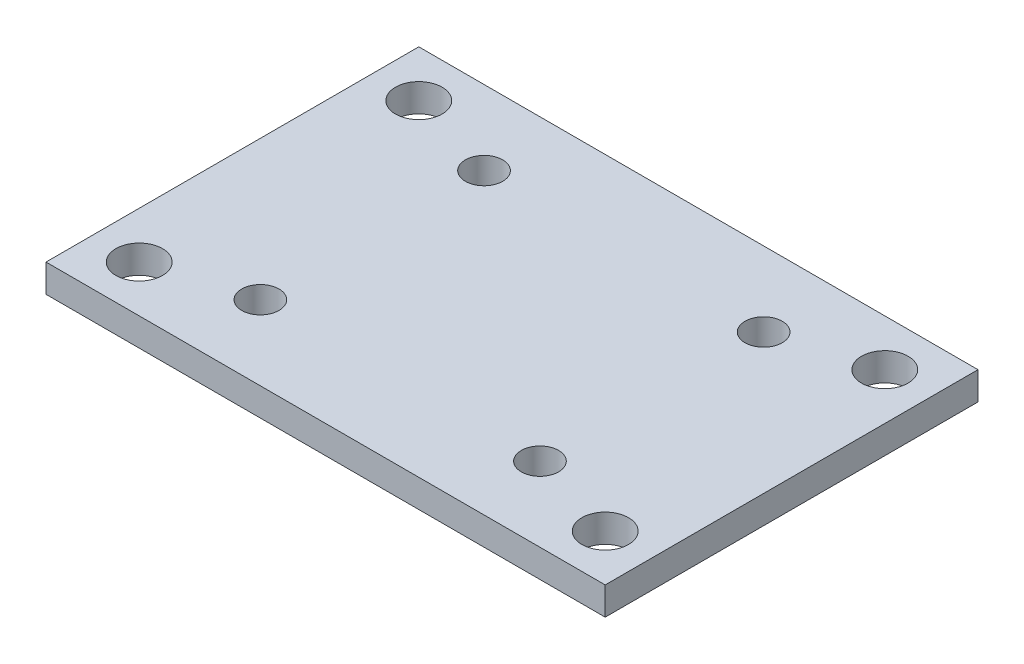
ISO-10303-21;
HEADER;
FILE_DESCRIPTION(('STEP AP214'),'2;1');
FILE_NAME('part.step','',(''),(''),'','','');
FILE_SCHEMA(('AUTOMOTIVE_DESIGN { 1 0 10303 214 1 1 1 1 }'));
ENDSEC;
DATA;
#1=APPLICATION_CONTEXT('core data for automotive mechanical design processes');
#2=APPLICATION_PROTOCOL_DEFINITION('international standard','automotive_design',2000,#1);
#3=PRODUCT_CONTEXT('',#1,'mechanical');
#4=PRODUCT('Part','Part','',(#3));
#5=PRODUCT_RELATED_PRODUCT_CATEGORY('part','',(#4));
#6=PRODUCT_DEFINITION_FORMATION('','',#4);
#7=PRODUCT_DEFINITION_CONTEXT('part definition',#1,'design');
#8=PRODUCT_DEFINITION('design','',#6,#7);
#9=PRODUCT_DEFINITION_SHAPE('','',#8);
#10=(LENGTH_UNIT() NAMED_UNIT(*) SI_UNIT(.MILLI.,.METRE.));
#11=(NAMED_UNIT(*) PLANE_ANGLE_UNIT() SI_UNIT($,.RADIAN.));
#12=(NAMED_UNIT(*) SI_UNIT($,.STERADIAN.) SOLID_ANGLE_UNIT());
#13=UNCERTAINTY_MEASURE_WITH_UNIT(LENGTH_MEASURE(1.E-05),#10,'distance_accuracy_value','');
#14=(GEOMETRIC_REPRESENTATION_CONTEXT(3) GLOBAL_UNCERTAINTY_ASSIGNED_CONTEXT((#13)) GLOBAL_UNIT_ASSIGNED_CONTEXT((#10,
#11,#12)) REPRESENTATION_CONTEXT('',''));
#15=CARTESIAN_POINT('',(0.,0.,0.));
#16=DIRECTION('',(0.,0.,1.));
#17=DIRECTION('',(1.,0.,0.));
#18=AXIS2_PLACEMENT_3D('',#15,#16,#17);
#19=CARTESIAN_POINT('',(-30.,3.,20.));
#20=DIRECTION('',(1.,0.,0.));
#21=DIRECTION('',(0.,0.,-1.));
#22=AXIS2_PLACEMENT_3D('',#19,#20,#21);
#23=PLANE('',#22);
#24=DIRECTION('',(0.,0.,1.));
#25=VECTOR('',#24,1.);
#26=CARTESIAN_POINT('',(-30.,0.,20.));
#27=LINE('',#26,#25);
#28=CARTESIAN_POINT('',(-30.,0.,-20.));
#29=VERTEX_POINT('',#28);
#30=CARTESIAN_POINT('',(-30.,0.,20.));
#31=VERTEX_POINT('',#30);
#32=EDGE_CURVE('E95',#29,#31,#27,.T.);
#33=ORIENTED_EDGE('',*,*,#32,.T.);
#34=DIRECTION('',(0.,-1.,0.));
#35=VECTOR('',#34,1.);
#36=CARTESIAN_POINT('',(-30.,3.,20.));
#37=LINE('',#36,#35);
#38=CARTESIAN_POINT('',(-30.,3.,20.));
#39=VERTEX_POINT('',#38);
#40=EDGE_CURVE('E11',#39,#31,#37,.T.);
#41=ORIENTED_EDGE('',*,*,#40,.F.);
#42=DIRECTION('',(0.,0.,1.));
#43=VECTOR('',#42,1.);
#44=CARTESIAN_POINT('',(-30.,3.,20.));
#45=LINE('',#44,#43);
#46=CARTESIAN_POINT('',(-30.,3.,-20.));
#47=VERTEX_POINT('',#46);
#48=EDGE_CURVE('E83',#47,#39,#45,.T.);
#49=ORIENTED_EDGE('',*,*,#48,.F.);
#50=DIRECTION('',(0.,-1.,0.));
#51=VECTOR('',#50,1.);
#52=CARTESIAN_POINT('',(-30.,3.,-20.));
#53=LINE('',#52,#51);
#54=EDGE_CURVE('E91',#47,#29,#53,.T.);
#55=ORIENTED_EDGE('',*,*,#54,.T.);
#56=EDGE_LOOP('',(#33,#41,#49,#55));
#57=FACE_BOUND('',#56,.T.);
#58=ADVANCED_FACE('F32',(#57),#23,.F.);
#59=CARTESIAN_POINT('',(30.,3.,20.));
#60=DIRECTION('',(0.,0.,-1.));
#61=DIRECTION('',(-1.,0.,0.));
#62=AXIS2_PLACEMENT_3D('',#59,#60,#61);
#63=PLANE('',#62);
#64=DIRECTION('',(1.,0.,0.));
#65=VECTOR('',#64,1.);
#66=CARTESIAN_POINT('',(30.,0.,20.));
#67=LINE('',#66,#65);
#68=CARTESIAN_POINT('',(30.,0.,20.));
#69=VERTEX_POINT('',#68);
#70=EDGE_CURVE('E87',#31,#69,#67,.T.);
#71=ORIENTED_EDGE('',*,*,#70,.T.);
#72=DIRECTION('',(0.,-1.,0.));
#73=VECTOR('',#72,1.);
#74=CARTESIAN_POINT('',(30.,3.,20.));
#75=LINE('',#74,#73);
#76=CARTESIAN_POINT('',(30.,3.,20.));
#77=VERTEX_POINT('',#76);
#78=EDGE_CURVE('E40',#77,#69,#75,.T.);
#79=ORIENTED_EDGE('',*,*,#78,.F.);
#80=DIRECTION('',(1.,0.,0.));
#81=VECTOR('',#80,1.);
#82=CARTESIAN_POINT('',(30.,3.,20.));
#83=LINE('',#82,#81);
#84=EDGE_CURVE('E78',#39,#77,#83,.T.);
#85=ORIENTED_EDGE('',*,*,#84,.F.);
#86=ORIENTED_EDGE('',*,*,#40,.T.);
#87=EDGE_LOOP('',(#71,#79,#85,#86));
#88=FACE_BOUND('',#87,.T.);
#89=ADVANCED_FACE('F86',(#88),#63,.F.);
#90=CARTESIAN_POINT('',(30.,3.,20.));
#91=DIRECTION('',(-1.,0.,0.));
#92=DIRECTION('',(0.,0.,1.));
#93=AXIS2_PLACEMENT_3D('',#90,#91,#92);
#94=PLANE('',#93);
#95=DIRECTION('',(0.,0.,-1.));
#96=VECTOR('',#95,1.);
#97=CARTESIAN_POINT('',(30.,0.,20.));
#98=LINE('',#97,#96);
#99=CARTESIAN_POINT('',(30.,0.,-20.));
#100=VERTEX_POINT('',#99);
#101=EDGE_CURVE('E65',#69,#100,#98,.T.);
#102=ORIENTED_EDGE('',*,*,#101,.T.);
#103=DIRECTION('',(0.,-1.,0.));
#104=VECTOR('',#103,1.);
#105=CARTESIAN_POINT('',(30.,3.,-20.));
#106=LINE('',#105,#104);
#107=CARTESIAN_POINT('',(30.,3.,-20.));
#108=VERTEX_POINT('',#107);
#109=EDGE_CURVE('E88',#108,#100,#106,.T.);
#110=ORIENTED_EDGE('',*,*,#109,.F.);
#111=DIRECTION('',(0.,0.,-1.));
#112=VECTOR('',#111,1.);
#113=CARTESIAN_POINT('',(30.,3.,20.));
#114=LINE('',#113,#112);
#115=EDGE_CURVE('E81',#77,#108,#114,.T.);
#116=ORIENTED_EDGE('',*,*,#115,.F.);
#117=ORIENTED_EDGE('',*,*,#78,.T.);
#118=EDGE_LOOP('',(#102,#110,#116,#117));
#119=FACE_BOUND('',#118,.T.);
#120=ADVANCED_FACE('F89',(#119),#94,.F.);
#121=CARTESIAN_POINT('',(30.,3.,-20.));
#122=DIRECTION('',(0.,0.,1.));
#123=DIRECTION('',(1.,0.,0.));
#124=AXIS2_PLACEMENT_3D('',#121,#122,#123);
#125=PLANE('',#124);
#126=DIRECTION('',(-1.,0.,0.));
#127=VECTOR('',#126,1.);
#128=CARTESIAN_POINT('',(30.,0.,-20.));
#129=LINE('',#128,#127);
#130=EDGE_CURVE('E71',#100,#29,#129,.T.);
#131=ORIENTED_EDGE('',*,*,#130,.T.);
#132=ORIENTED_EDGE('',*,*,#54,.F.);
#133=DIRECTION('',(-1.,0.,0.));
#134=VECTOR('',#133,1.);
#135=CARTESIAN_POINT('',(30.,3.,-20.));
#136=LINE('',#135,#134);
#137=EDGE_CURVE('E48',#108,#47,#136,.T.);
#138=ORIENTED_EDGE('',*,*,#137,.F.);
#139=ORIENTED_EDGE('',*,*,#109,.T.);
#140=EDGE_LOOP('',(#131,#132,#138,#139));
#141=FACE_BOUND('',#140,.T.);
#142=ADVANCED_FACE('F103',(#141),#125,.F.);
#143=CARTESIAN_POINT('',(0.,3.,0.));
#144=DIRECTION('',(0.,1.,0.));
#145=DIRECTION('',(0.,0.,1.));
#146=AXIS2_PLACEMENT_3D('',#143,#144,#145);
#147=PLANE('',#146);
#148=CARTESIAN_POINT('',(-25.,3.,15.));
#149=DIRECTION('',(0.,1.,0.));
#150=DIRECTION('',(0.,0.,1.));
#151=AXIS2_PLACEMENT_3D('',#148,#149,#150);
#152=CIRCLE('',#151,2.5);
#153=CARTESIAN_POINT('',(-25.,3.,17.5));
#154=VERTEX_POINT('',#153);
#155=EDGE_CURVE('E146',#154,#154,#152,.T.);
#156=ORIENTED_EDGE('',*,*,#155,.F.);
#157=EDGE_LOOP('',(#156));
#158=FACE_BOUND('',#157,.T.);
#159=CARTESIAN_POINT('',(25.,3.,-15.));
#160=DIRECTION('',(0.,1.,0.));
#161=DIRECTION('',(0.,0.,1.));
#162=AXIS2_PLACEMENT_3D('',#159,#160,#161);
#163=CIRCLE('',#162,2.5);
#164=CARTESIAN_POINT('',(25.,3.,-12.5));
#165=VERTEX_POINT('',#164);
#166=EDGE_CURVE('E139',#165,#165,#163,.T.);
#167=ORIENTED_EDGE('',*,*,#166,.F.);
#168=EDGE_LOOP('',(#167));
#169=FACE_BOUND('',#168,.T.);
#170=CARTESIAN_POINT('',(25.,3.,15.));
#171=DIRECTION('',(0.,1.,0.));
#172=DIRECTION('',(0.,0.,1.));
#173=AXIS2_PLACEMENT_3D('',#170,#171,#172);
#174=CIRCLE('',#173,2.5);
#175=CARTESIAN_POINT('',(25.,3.,17.5));
#176=VERTEX_POINT('',#175);
#177=EDGE_CURVE('E151',#176,#176,#174,.T.);
#178=ORIENTED_EDGE('',*,*,#177,.F.);
#179=EDGE_LOOP('',(#178));
#180=FACE_BOUND('',#179,.T.);
#181=CARTESIAN_POINT('',(-25.,3.,-15.));
#182=DIRECTION('',(0.,1.,0.));
#183=DIRECTION('',(0.,0.,1.));
#184=AXIS2_PLACEMENT_3D('',#181,#182,#183);
#185=CIRCLE('',#184,2.5);
#186=CARTESIAN_POINT('',(-25.,3.,-12.5));
#187=VERTEX_POINT('',#186);
#188=EDGE_CURVE('E133',#187,#187,#185,.T.);
#189=ORIENTED_EDGE('',*,*,#188,.F.);
#190=EDGE_LOOP('',(#189));
#191=FACE_BOUND('',#190,.T.);
#192=CARTESIAN_POINT('',(-15.,3.,12.));
#193=DIRECTION('',(0.,1.,0.));
#194=DIRECTION('',(0.,0.,1.));
#195=AXIS2_PLACEMENT_3D('',#192,#193,#194);
#196=CIRCLE('',#195,2.);
#197=CARTESIAN_POINT('',(-15.,3.,14.));
#198=VERTEX_POINT('',#197);
#199=EDGE_CURVE('E115',#198,#198,#196,.T.);
#200=ORIENTED_EDGE('',*,*,#199,.F.);
#201=EDGE_LOOP('',(#200));
#202=FACE_BOUND('',#201,.T.);
#203=CARTESIAN_POINT('',(15.,3.,12.));
#204=DIRECTION('',(0.,1.,0.));
#205=DIRECTION('',(0.,0.,1.));
#206=AXIS2_PLACEMENT_3D('',#203,#204,#205);
#207=CIRCLE('',#206,2.);
#208=CARTESIAN_POINT('',(15.,3.,14.));
#209=VERTEX_POINT('',#208);
#210=EDGE_CURVE('E122',#209,#209,#207,.T.);
#211=ORIENTED_EDGE('',*,*,#210,.F.);
#212=EDGE_LOOP('',(#211));
#213=FACE_BOUND('',#212,.T.);
#214=CARTESIAN_POINT('',(15.,3.,-12.));
#215=DIRECTION('',(0.,1.,0.));
#216=DIRECTION('',(0.,0.,1.));
#217=AXIS2_PLACEMENT_3D('',#214,#215,#216);
#218=CIRCLE('',#217,2.);
#219=CARTESIAN_POINT('',(15.,3.,-10.));
#220=VERTEX_POINT('',#219);
#221=EDGE_CURVE('E128',#220,#220,#218,.T.);
#222=ORIENTED_EDGE('',*,*,#221,.F.);
#223=EDGE_LOOP('',(#222));
#224=FACE_BOUND('',#223,.T.);
#225=CARTESIAN_POINT('',(-15.,3.,-12.));
#226=DIRECTION('',(0.,1.,0.));
#227=DIRECTION('',(0.,0.,1.));
#228=AXIS2_PLACEMENT_3D('',#225,#226,#227);
#229=CIRCLE('',#228,2.);
#230=CARTESIAN_POINT('',(-15.,3.,-10.));
#231=VERTEX_POINT('',#230);
#232=EDGE_CURVE('E109',#231,#231,#229,.T.);
#233=ORIENTED_EDGE('',*,*,#232,.F.);
#234=EDGE_LOOP('',(#233));
#235=FACE_BOUND('',#234,.T.);
#236=ORIENTED_EDGE('',*,*,#48,.T.);
#237=ORIENTED_EDGE('',*,*,#84,.T.);
#238=ORIENTED_EDGE('',*,*,#115,.T.);
#239=ORIENTED_EDGE('',*,*,#137,.T.);
#240=EDGE_LOOP('',(#236,#237,#238,#239));
#241=FACE_BOUND('',#240,.T.);
#242=ADVANCED_FACE('F79',(#158,#169,#180,#191,#202,#213,#224,#235,#241),#147,.T.);
#243=CARTESIAN_POINT('',(0.,0.,0.));
#244=DIRECTION('',(0.,1.,0.));
#245=DIRECTION('',(0.,0.,1.));
#246=AXIS2_PLACEMENT_3D('',#243,#244,#245);
#247=PLANE('',#246);
#248=CARTESIAN_POINT('',(-25.,0.,15.));
#249=DIRECTION('',(0.,1.,0.));
#250=DIRECTION('',(0.,0.,1.));
#251=AXIS2_PLACEMENT_3D('',#248,#249,#250);
#252=CIRCLE('',#251,2.5);
#253=CARTESIAN_POINT('',(-25.,0.,17.5));
#254=VERTEX_POINT('',#253);
#255=EDGE_CURVE('E136',#254,#254,#252,.T.);
#256=ORIENTED_EDGE('',*,*,#255,.T.);
#257=EDGE_LOOP('',(#256));
#258=FACE_BOUND('',#257,.T.);
#259=CARTESIAN_POINT('',(25.,0.,-15.));
#260=DIRECTION('',(0.,1.,0.));
#261=DIRECTION('',(0.,0.,1.));
#262=AXIS2_PLACEMENT_3D('',#259,#260,#261);
#263=CIRCLE('',#262,2.5);
#264=CARTESIAN_POINT('',(25.,0.,-12.5));
#265=VERTEX_POINT('',#264);
#266=EDGE_CURVE('E142',#265,#265,#263,.T.);
#267=ORIENTED_EDGE('',*,*,#266,.T.);
#268=EDGE_LOOP('',(#267));
#269=FACE_BOUND('',#268,.T.);
#270=CARTESIAN_POINT('',(25.,0.,15.));
#271=DIRECTION('',(0.,1.,0.));
#272=DIRECTION('',(0.,0.,1.));
#273=AXIS2_PLACEMENT_3D('',#270,#271,#272);
#274=CIRCLE('',#273,2.5);
#275=CARTESIAN_POINT('',(25.,0.,17.5));
#276=VERTEX_POINT('',#275);
#277=EDGE_CURVE('E143',#276,#276,#274,.T.);
#278=ORIENTED_EDGE('',*,*,#277,.T.);
#279=EDGE_LOOP('',(#278));
#280=FACE_BOUND('',#279,.T.);
#281=CARTESIAN_POINT('',(-25.,0.,-15.));
#282=DIRECTION('',(0.,1.,0.));
#283=DIRECTION('',(0.,0.,1.));
#284=AXIS2_PLACEMENT_3D('',#281,#282,#283);
#285=CIRCLE('',#284,2.5);
#286=CARTESIAN_POINT('',(-25.,0.,-12.5));
#287=VERTEX_POINT('',#286);
#288=EDGE_CURVE('E119',#287,#287,#285,.T.);
#289=ORIENTED_EDGE('',*,*,#288,.T.);
#290=EDGE_LOOP('',(#289));
#291=FACE_BOUND('',#290,.T.);
#292=CARTESIAN_POINT('',(-15.,0.,12.));
#293=DIRECTION('',(0.,1.,0.));
#294=DIRECTION('',(0.,0.,1.));
#295=AXIS2_PLACEMENT_3D('',#292,#293,#294);
#296=CIRCLE('',#295,2.);
#297=CARTESIAN_POINT('',(-15.,0.,14.));
#298=VERTEX_POINT('',#297);
#299=EDGE_CURVE('E118',#298,#298,#296,.T.);
#300=ORIENTED_EDGE('',*,*,#299,.T.);
#301=EDGE_LOOP('',(#300));
#302=FACE_BOUND('',#301,.T.);
#303=CARTESIAN_POINT('',(15.,0.,12.));
#304=DIRECTION('',(0.,1.,0.));
#305=DIRECTION('',(0.,0.,1.));
#306=AXIS2_PLACEMENT_3D('',#303,#304,#305);
#307=CIRCLE('',#306,2.);
#308=CARTESIAN_POINT('',(15.,0.,14.));
#309=VERTEX_POINT('',#308);
#310=EDGE_CURVE('E125',#309,#309,#307,.T.);
#311=ORIENTED_EDGE('',*,*,#310,.T.);
#312=EDGE_LOOP('',(#311));
#313=FACE_BOUND('',#312,.T.);
#314=CARTESIAN_POINT('',(15.,0.,-12.));
#315=DIRECTION('',(0.,1.,0.));
#316=DIRECTION('',(0.,0.,1.));
#317=AXIS2_PLACEMENT_3D('',#314,#315,#316);
#318=CIRCLE('',#317,2.);
#319=CARTESIAN_POINT('',(15.,0.,-10.));
#320=VERTEX_POINT('',#319);
#321=EDGE_CURVE('E112',#320,#320,#318,.T.);
#322=ORIENTED_EDGE('',*,*,#321,.T.);
#323=EDGE_LOOP('',(#322));
#324=FACE_BOUND('',#323,.T.);
#325=CARTESIAN_POINT('',(-15.,0.,-12.));
#326=DIRECTION('',(0.,1.,0.));
#327=DIRECTION('',(0.,0.,1.));
#328=AXIS2_PLACEMENT_3D('',#325,#326,#327);
#329=CIRCLE('',#328,2.);
#330=CARTESIAN_POINT('',(-15.,0.,-10.));
#331=VERTEX_POINT('',#330);
#332=EDGE_CURVE('E98',#331,#331,#329,.T.);
#333=ORIENTED_EDGE('',*,*,#332,.T.);
#334=EDGE_LOOP('',(#333));
#335=FACE_BOUND('',#334,.T.);
#336=ORIENTED_EDGE('',*,*,#32,.F.);
#337=ORIENTED_EDGE('',*,*,#130,.F.);
#338=ORIENTED_EDGE('',*,*,#101,.F.);
#339=ORIENTED_EDGE('',*,*,#70,.F.);
#340=EDGE_LOOP('',(#336,#337,#338,#339));
#341=FACE_BOUND('',#340,.T.);
#342=ADVANCED_FACE('F106',(#258,#269,#280,#291,#302,#313,#324,#335,#341),#247,.F.);
#343=CARTESIAN_POINT('',(-15.,0.,-12.));
#344=DIRECTION('',(0.,1.,0.));
#345=DIRECTION('',(0.,0.,1.));
#346=AXIS2_PLACEMENT_3D('',#343,#344,#345);
#347=CYLINDRICAL_SURFACE('',#346,2.);
#348=ORIENTED_EDGE('',*,*,#332,.F.);
#349=EDGE_LOOP('',(#348));
#350=FACE_BOUND('',#349,.T.);
#351=ORIENTED_EDGE('',*,*,#232,.T.);
#352=EDGE_LOOP('',(#351));
#353=FACE_BOUND('',#352,.T.);
#354=ADVANCED_FACE('F181',(#350,#353),#347,.F.);
#355=CARTESIAN_POINT('',(15.,0.,-12.));
#356=DIRECTION('',(0.,1.,0.));
#357=DIRECTION('',(0.,0.,1.));
#358=AXIS2_PLACEMENT_3D('',#355,#356,#357);
#359=CYLINDRICAL_SURFACE('',#358,2.);
#360=ORIENTED_EDGE('',*,*,#321,.F.);
#361=EDGE_LOOP('',(#360));
#362=FACE_BOUND('',#361,.T.);
#363=ORIENTED_EDGE('',*,*,#221,.T.);
#364=EDGE_LOOP('',(#363));
#365=FACE_BOUND('',#364,.T.);
#366=ADVANCED_FACE('F183',(#362,#365),#359,.F.);
#367=CARTESIAN_POINT('',(15.,0.,12.));
#368=DIRECTION('',(0.,1.,0.));
#369=DIRECTION('',(0.,0.,1.));
#370=AXIS2_PLACEMENT_3D('',#367,#368,#369);
#371=CYLINDRICAL_SURFACE('',#370,2.);
#372=ORIENTED_EDGE('',*,*,#310,.F.);
#373=EDGE_LOOP('',(#372));
#374=FACE_BOUND('',#373,.T.);
#375=ORIENTED_EDGE('',*,*,#210,.T.);
#376=EDGE_LOOP('',(#375));
#377=FACE_BOUND('',#376,.T.);
#378=ADVANCED_FACE('F190',(#374,#377),#371,.F.);
#379=CARTESIAN_POINT('',(-15.,0.,12.));
#380=DIRECTION('',(0.,1.,0.));
#381=DIRECTION('',(0.,0.,1.));
#382=AXIS2_PLACEMENT_3D('',#379,#380,#381);
#383=CYLINDRICAL_SURFACE('',#382,2.);
#384=ORIENTED_EDGE('',*,*,#299,.F.);
#385=EDGE_LOOP('',(#384));
#386=FACE_BOUND('',#385,.T.);
#387=ORIENTED_EDGE('',*,*,#199,.T.);
#388=EDGE_LOOP('',(#387));
#389=FACE_BOUND('',#388,.T.);
#390=ADVANCED_FACE('F230',(#386,#389),#383,.F.);
#391=CARTESIAN_POINT('',(-25.,0.,-15.));
#392=DIRECTION('',(0.,1.,0.));
#393=DIRECTION('',(0.,0.,1.));
#394=AXIS2_PLACEMENT_3D('',#391,#392,#393);
#395=CYLINDRICAL_SURFACE('',#394,2.5);
#396=ORIENTED_EDGE('',*,*,#288,.F.);
#397=EDGE_LOOP('',(#396));
#398=FACE_BOUND('',#397,.T.);
#399=ORIENTED_EDGE('',*,*,#188,.T.);
#400=EDGE_LOOP('',(#399));
#401=FACE_BOUND('',#400,.T.);
#402=ADVANCED_FACE('F163',(#398,#401),#395,.F.);
#403=CARTESIAN_POINT('',(25.,0.,15.));
#404=DIRECTION('',(0.,1.,0.));
#405=DIRECTION('',(0.,0.,1.));
#406=AXIS2_PLACEMENT_3D('',#403,#404,#405);
#407=CYLINDRICAL_SURFACE('',#406,2.5);
#408=ORIENTED_EDGE('',*,*,#277,.F.);
#409=EDGE_LOOP('',(#408));
#410=FACE_BOUND('',#409,.T.);
#411=ORIENTED_EDGE('',*,*,#177,.T.);
#412=EDGE_LOOP('',(#411));
#413=FACE_BOUND('',#412,.T.);
#414=ADVANCED_FACE('F159',(#410,#413),#407,.F.);
#415=CARTESIAN_POINT('',(25.,0.,-15.));
#416=DIRECTION('',(0.,1.,0.));
#417=DIRECTION('',(0.,0.,1.));
#418=AXIS2_PLACEMENT_3D('',#415,#416,#417);
#419=CYLINDRICAL_SURFACE('',#418,2.5);
#420=ORIENTED_EDGE('',*,*,#266,.F.);
#421=EDGE_LOOP('',(#420));
#422=FACE_BOUND('',#421,.T.);
#423=ORIENTED_EDGE('',*,*,#166,.T.);
#424=EDGE_LOOP('',(#423));
#425=FACE_BOUND('',#424,.T.);
#426=ADVANCED_FACE('F162',(#422,#425),#419,.F.);
#427=CARTESIAN_POINT('',(-25.,0.,15.));
#428=DIRECTION('',(0.,1.,0.));
#429=DIRECTION('',(0.,0.,1.));
#430=AXIS2_PLACEMENT_3D('',#427,#428,#429);
#431=CYLINDRICAL_SURFACE('',#430,2.5);
#432=ORIENTED_EDGE('',*,*,#255,.F.);
#433=EDGE_LOOP('',(#432));
#434=FACE_BOUND('',#433,.T.);
#435=ORIENTED_EDGE('',*,*,#155,.T.);
#436=EDGE_LOOP('',(#435));
#437=FACE_BOUND('',#436,.T.);
#438=ADVANCED_FACE('F248',(#434,#437),#431,.F.);
#439=CLOSED_SHELL('',(#58,#89,#120,#142,#242,#342,#354,#366,#378,#390,#402,#414,#426,#438));
#440=MANIFOLD_SOLID_BREP('B2',#439);
#441=ADVANCED_BREP_SHAPE_REPRESENTATION('',(#18,#440),#14);
#442=SHAPE_DEFINITION_REPRESENTATION(#9,#441);
ENDSEC;
END-ISO-10303-21;
